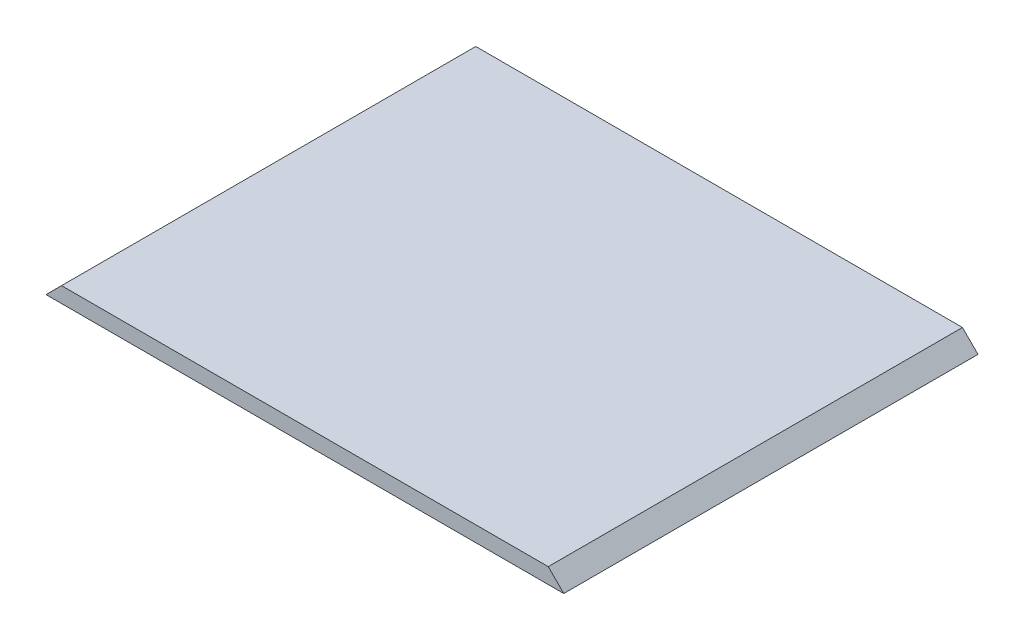
ISO-10303-21;
HEADER;
FILE_DESCRIPTION(('STEP AP214'),'2;1');
FILE_NAME('part.step','',(''),(''),'','','');
FILE_SCHEMA(('AUTOMOTIVE_DESIGN { 1 0 10303 214 1 1 1 1 }'));
ENDSEC;
DATA;
#1=APPLICATION_CONTEXT('core data for automotive mechanical design processes');
#2=APPLICATION_PROTOCOL_DEFINITION('international standard','automotive_design',2000,#1);
#3=PRODUCT_CONTEXT('',#1,'mechanical');
#4=PRODUCT('Part','Part','',(#3));
#5=PRODUCT_RELATED_PRODUCT_CATEGORY('part','',(#4));
#6=PRODUCT_DEFINITION_FORMATION('','',#4);
#7=PRODUCT_DEFINITION_CONTEXT('part definition',#1,'design');
#8=PRODUCT_DEFINITION('design','',#6,#7);
#9=PRODUCT_DEFINITION_SHAPE('','',#8);
#10=(LENGTH_UNIT() NAMED_UNIT(*) SI_UNIT(.MILLI.,.METRE.));
#11=(NAMED_UNIT(*) PLANE_ANGLE_UNIT() SI_UNIT($,.RADIAN.));
#12=(NAMED_UNIT(*) SI_UNIT($,.STERADIAN.) SOLID_ANGLE_UNIT());
#13=UNCERTAINTY_MEASURE_WITH_UNIT(LENGTH_MEASURE(1.E-05),#10,'distance_accuracy_value','');
#14=(GEOMETRIC_REPRESENTATION_CONTEXT(3) GLOBAL_UNCERTAINTY_ASSIGNED_CONTEXT((#13)) GLOBAL_UNIT_ASSIGNED_CONTEXT((#10,
#11,#12)) REPRESENTATION_CONTEXT('',''));
#15=CARTESIAN_POINT('',(0.,0.,0.));
#16=DIRECTION('',(0.,0.,1.));
#17=DIRECTION('',(1.,0.,0.));
#18=AXIS2_PLACEMENT_3D('',#15,#16,#17);
#19=CARTESIAN_POINT('',(-0.47,0.605,-0.4));
#20=DIRECTION('',(0.,-1.,0.));
#21=DIRECTION('',(0.,0.,-1.));
#22=AXIS2_PLACEMENT_3D('',#19,#20,#21);
#23=PLANE('',#22);
#24=DIRECTION('',(0.,0.,1.));
#25=VECTOR('',#24,1.);
#26=CARTESIAN_POINT('',(0.46999999997025,0.60500000002975,-0.4));
#27=LINE('',#26,#25);
#28=CARTESIAN_POINT('',(0.469999999881,0.605000000014875,0.4));
#29=VERTEX_POINT('',#28);
#30=CARTESIAN_POINT('',(0.469999999854969,0.605000000011156,-0.4));
#31=VERTEX_POINT('',#30);
#32=EDGE_CURVE('E20',#29,#31,#27,.F.);
#33=ORIENTED_EDGE('',*,*,#32,.T.);
#34=DIRECTION('',(-1.,0.,0.));
#35=VECTOR('',#34,1.);
#36=CARTESIAN_POINT('',(0.506,0.605000000014875,-0.4));
#37=LINE('',#36,#35);
#38=CARTESIAN_POINT('',(-0.46999999991075,0.605000000022312,-0.4));
#39=VERTEX_POINT('',#38);
#40=EDGE_CURVE('E55',#39,#31,#37,.F.);
#41=ORIENTED_EDGE('',*,*,#40,.F.);
#42=DIRECTION('',(0.,0.,1.));
#43=VECTOR('',#42,1.);
#44=CARTESIAN_POINT('',(-0.4699999999405,0.6050000000595,-0.4));
#45=LINE('',#44,#43);
#46=CARTESIAN_POINT('',(-0.469999999925625,0.605000000037187,0.4));
#47=VERTEX_POINT('',#46);
#48=EDGE_CURVE('E74',#39,#47,#45,.T.);
#49=ORIENTED_EDGE('',*,*,#48,.T.);
#50=DIRECTION('',(-1.,0.,0.));
#51=VECTOR('',#50,1.);
#52=CARTESIAN_POINT('',(0.506,0.60500000002975,0.4));
#53=LINE('',#52,#51);
#54=EDGE_CURVE('E66',#47,#29,#53,.F.);
#55=ORIENTED_EDGE('',*,*,#54,.T.);
#56=EDGE_LOOP('',(#33,#41,#49,#55));
#57=FACE_BOUND('',#56,.T.);
#58=ADVANCED_FACE('F17',(#57),#23,.F.);
#59=CARTESIAN_POINT('',(0.47,0.605,-0.4));
#60=DIRECTION('',(-0.707106781186548,-0.707106781186548,0.));
#61=DIRECTION('',(0.707106781186548,-0.707106781186548,0.));
#62=AXIS2_PLACEMENT_3D('',#59,#60,#61);
#63=PLANE('',#62);
#64=DIRECTION('',(0.,0.,1.));
#65=VECTOR('',#64,1.);
#66=CARTESIAN_POINT('',(0.4999999999845,0.575,-0.4));
#67=LINE('',#66,#65);
#68=CARTESIAN_POINT('',(0.499999999969,0.575000000027125,0.4));
#69=VERTEX_POINT('',#68);
#70=CARTESIAN_POINT('',(0.4999999999535,0.575000000027125,-0.4));
#71=VERTEX_POINT('',#70);
#72=EDGE_CURVE('E72',#69,#71,#67,.F.);
#73=ORIENTED_EDGE('',*,*,#72,.T.);
#74=DIRECTION('',(0.707106782559514,-0.707106779813581,0.));
#75=VECTOR('',#74,1.);
#76=CARTESIAN_POINT('',(0.4699999998215,0.605,-0.4));
#77=LINE('',#76,#75);
#78=EDGE_CURVE('E62',#31,#71,#77,.T.);
#79=ORIENTED_EDGE('',*,*,#78,.F.);
#80=ORIENTED_EDGE('',*,*,#32,.F.);
#81=DIRECTION('',(0.707106781887762,-0.707106780485333,0.));
#82=VECTOR('',#81,1.);
#83=CARTESIAN_POINT('',(0.4699999999405,0.605,0.4));
#84=LINE('',#83,#82);
#85=EDGE_CURVE('E80',#29,#69,#84,.T.);
#86=ORIENTED_EDGE('',*,*,#85,.T.);
#87=EDGE_LOOP('',(#73,#79,#80,#86));
#88=FACE_BOUND('',#87,.T.);
#89=ADVANCED_FACE('F71',(#88),#63,.F.);
#90=CARTESIAN_POINT('',(0.506,0.575,-0.4));
#91=DIRECTION('',(0.,0.,-1.));
#92=DIRECTION('',(-1.,0.,0.));
#93=AXIS2_PLACEMENT_3D('',#90,#91,#92);
#94=PLANE('',#93);
#95=ORIENTED_EDGE('',*,*,#78,.T.);
#96=DIRECTION('',(1.,0.,0.));
#97=VECTOR('',#96,1.);
#98=CARTESIAN_POINT('',(-0.5,0.575,-0.4));
#99=LINE('',#98,#97);
#100=CARTESIAN_POINT('',(-0.499999999939938,0.575000000021312,-0.4));
#101=VERTEX_POINT('',#100);
#102=EDGE_CURVE('E83',#71,#101,#99,.F.);
#103=ORIENTED_EDGE('',*,*,#102,.T.);
#104=DIRECTION('',(0.707106781186548,0.707106781186548,0.));
#105=VECTOR('',#104,1.);
#106=CARTESIAN_POINT('',(-0.5,0.575,-0.4));
#107=LINE('',#106,#105);
#108=EDGE_CURVE('E64',#101,#39,#107,.T.);
#109=ORIENTED_EDGE('',*,*,#108,.T.);
#110=ORIENTED_EDGE('',*,*,#40,.T.);
#111=EDGE_LOOP('',(#95,#103,#109,#110));
#112=FACE_BOUND('',#111,.T.);
#113=ADVANCED_FACE('F59',(#112),#94,.T.);
#114=CARTESIAN_POINT('',(-0.5,0.575,-0.4));
#115=DIRECTION('',(0.707106781186548,-0.707106781186548,0.));
#116=DIRECTION('',(0.707106781186548,0.707106781186548,0.));
#117=AXIS2_PLACEMENT_3D('',#114,#115,#116);
#118=PLANE('',#117);
#119=ORIENTED_EDGE('',*,*,#48,.F.);
#120=ORIENTED_EDGE('',*,*,#108,.F.);
#121=DIRECTION('',(0.,0.,1.));
#122=VECTOR('',#121,1.);
#123=CARTESIAN_POINT('',(-0.499999999938,0.575,-0.4));
#124=LINE('',#123,#122);
#125=CARTESIAN_POINT('',(-0.499999999941875,0.575000000031,0.4));
#126=VERTEX_POINT('',#125);
#127=EDGE_CURVE('E26',#101,#126,#124,.T.);
#128=ORIENTED_EDGE('',*,*,#127,.T.);
#129=DIRECTION('',(0.707106781339755,0.70710678103334,0.));
#130=VECTOR('',#129,1.);
#131=CARTESIAN_POINT('',(-0.4999999999225,0.575000000031,0.4));
#132=LINE('',#131,#130);
#133=EDGE_CURVE('E34',#126,#47,#132,.T.);
#134=ORIENTED_EDGE('',*,*,#133,.T.);
#135=EDGE_LOOP('',(#119,#120,#128,#134));
#136=FACE_BOUND('',#135,.T.);
#137=ADVANCED_FACE('F88',(#136),#118,.F.);
#138=CARTESIAN_POINT('',(0.506,0.575,0.4));
#139=DIRECTION('',(0.,0.,-1.));
#140=DIRECTION('',(-1.,0.,0.));
#141=AXIS2_PLACEMENT_3D('',#138,#139,#140);
#142=PLANE('',#141);
#143=ORIENTED_EDGE('',*,*,#54,.F.);
#144=ORIENTED_EDGE('',*,*,#133,.F.);
#145=DIRECTION('',(1.,0.,0.));
#146=VECTOR('',#145,1.);
#147=CARTESIAN_POINT('',(-0.5,0.575,0.4));
#148=LINE('',#147,#146);
#149=EDGE_CURVE('E11',#126,#69,#148,.T.);
#150=ORIENTED_EDGE('',*,*,#149,.T.);
#151=ORIENTED_EDGE('',*,*,#85,.F.);
#152=EDGE_LOOP('',(#143,#144,#150,#151));
#153=FACE_BOUND('',#152,.T.);
#154=ADVANCED_FACE('F91',(#153),#142,.F.);
#155=CARTESIAN_POINT('',(-0.5,0.575,-0.4));
#156=DIRECTION('',(0.,1.,0.));
#157=DIRECTION('',(0.,0.,1.));
#158=AXIS2_PLACEMENT_3D('',#155,#156,#157);
#159=PLANE('',#158);
#160=ORIENTED_EDGE('',*,*,#127,.F.);
#161=ORIENTED_EDGE('',*,*,#102,.F.);
#162=ORIENTED_EDGE('',*,*,#72,.F.);
#163=ORIENTED_EDGE('',*,*,#149,.F.);
#164=EDGE_LOOP('',(#160,#161,#162,#163));
#165=FACE_BOUND('',#164,.T.);
#166=ADVANCED_FACE('F90',(#165),#159,.F.);
#167=CLOSED_SHELL('',(#58,#89,#113,#137,#154,#166));
#168=MANIFOLD_SOLID_BREP('B1',#167);
#169=ADVANCED_BREP_SHAPE_REPRESENTATION('',(#18,#168),#14);
#170=SHAPE_DEFINITION_REPRESENTATION(#9,#169);
ENDSEC;
END-ISO-10303-21;
